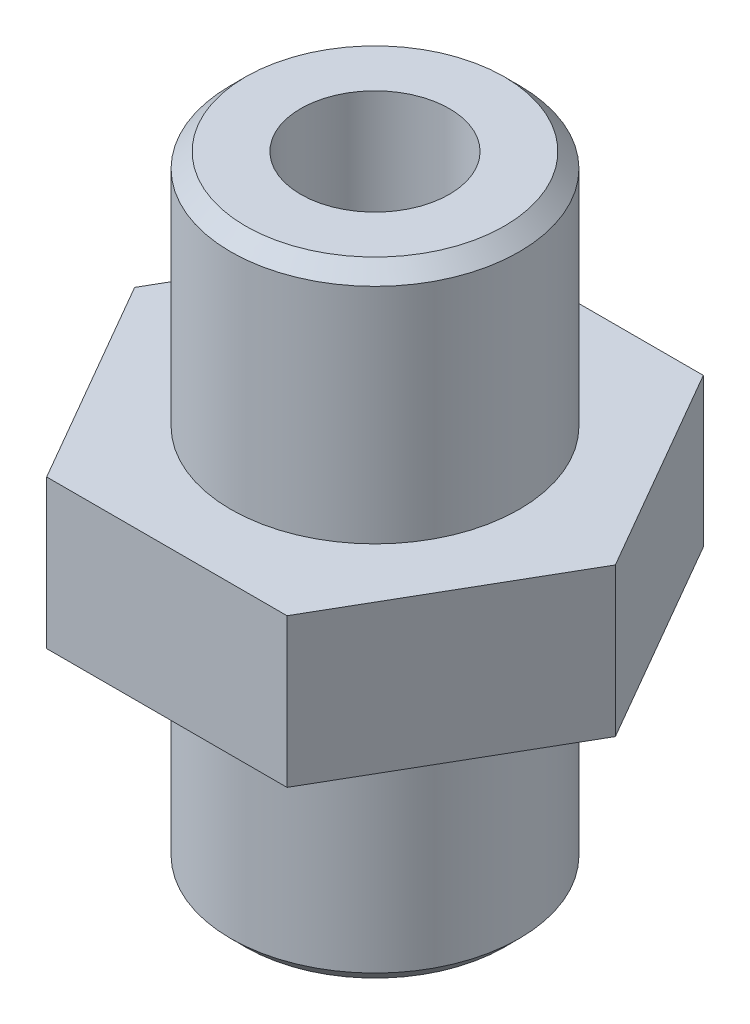
ISO-10303-21;
HEADER;
FILE_DESCRIPTION(('STEP AP214'),'2;1');
FILE_NAME('part.step','',(''),(''),'','','');
FILE_SCHEMA(('AUTOMOTIVE_DESIGN { 1 0 10303 214 1 1 1 1 }'));
ENDSEC;
DATA;
#1=APPLICATION_CONTEXT('core data for automotive mechanical design processes');
#2=APPLICATION_PROTOCOL_DEFINITION('international standard','automotive_design',2000,#1);
#3=PRODUCT_CONTEXT('',#1,'mechanical');
#4=PRODUCT('Part','Part','',(#3));
#5=PRODUCT_RELATED_PRODUCT_CATEGORY('part','',(#4));
#6=PRODUCT_DEFINITION_FORMATION('','',#4);
#7=PRODUCT_DEFINITION_CONTEXT('part definition',#1,'design');
#8=PRODUCT_DEFINITION('design','',#6,#7);
#9=PRODUCT_DEFINITION_SHAPE('','',#8);
#10=(LENGTH_UNIT() NAMED_UNIT(*) SI_UNIT(.MILLI.,.METRE.));
#11=(NAMED_UNIT(*) PLANE_ANGLE_UNIT() SI_UNIT($,.RADIAN.));
#12=(NAMED_UNIT(*) SI_UNIT($,.STERADIAN.) SOLID_ANGLE_UNIT());
#13=UNCERTAINTY_MEASURE_WITH_UNIT(LENGTH_MEASURE(1.E-05),#10,'distance_accuracy_value','');
#14=(GEOMETRIC_REPRESENTATION_CONTEXT(3) GLOBAL_UNCERTAINTY_ASSIGNED_CONTEXT((#13)) GLOBAL_UNIT_ASSIGNED_CONTEXT((#10,
#11,#12)) REPRESENTATION_CONTEXT('',''));
#15=CARTESIAN_POINT('',(0.,0.,0.));
#16=DIRECTION('',(0.,0.,1.));
#17=DIRECTION('',(1.,0.,0.));
#18=AXIS2_PLACEMENT_3D('',#15,#16,#17);
#19=CARTESIAN_POINT('',(-4.04145188432738,5.,7.));
#20=DIRECTION('',(0.,0.,-1.));
#21=DIRECTION('',(-1.,0.,0.));
#22=AXIS2_PLACEMENT_3D('',#19,#20,#21);
#23=PLANE('',#22);
#24=DIRECTION('',(1.,0.,0.));
#25=VECTOR('',#24,1.);
#26=CARTESIAN_POINT('',(-4.04145188432738,0.,7.));
#27=LINE('',#26,#25);
#28=CARTESIAN_POINT('',(-4.04145188432738,0.,7.));
#29=VERTEX_POINT('',#28);
#30=CARTESIAN_POINT('',(4.04145188432738,0.,7.));
#31=VERTEX_POINT('',#30);
#32=EDGE_CURVE('E124',#29,#31,#27,.T.);
#33=ORIENTED_EDGE('',*,*,#32,.T.);
#34=DIRECTION('',(0.,-1.,0.));
#35=VECTOR('',#34,1.);
#36=CARTESIAN_POINT('',(4.04145188432738,5.,7.));
#37=LINE('',#36,#35);
#38=CARTESIAN_POINT('',(4.04145188432738,5.,7.));
#39=VERTEX_POINT('',#38);
#40=EDGE_CURVE('E142',#39,#31,#37,.T.);
#41=ORIENTED_EDGE('',*,*,#40,.F.);
#42=DIRECTION('',(1.,0.,0.));
#43=VECTOR('',#42,1.);
#44=CARTESIAN_POINT('',(-4.04145188432738,5.,7.));
#45=LINE('',#44,#43);
#46=CARTESIAN_POINT('',(-4.04145188432738,5.,7.));
#47=VERTEX_POINT('',#46);
#48=EDGE_CURVE('E135',#47,#39,#45,.T.);
#49=ORIENTED_EDGE('',*,*,#48,.F.);
#50=DIRECTION('',(0.,-1.,0.));
#51=VECTOR('',#50,1.);
#52=CARTESIAN_POINT('',(-4.04145188432738,5.,7.));
#53=LINE('',#52,#51);
#54=EDGE_CURVE('E120',#47,#29,#53,.T.);
#55=ORIENTED_EDGE('',*,*,#54,.T.);
#56=EDGE_LOOP('',(#33,#41,#49,#55));
#57=FACE_BOUND('',#56,.T.);
#58=ADVANCED_FACE('F38',(#57),#23,.F.);
#59=CARTESIAN_POINT('',(4.04145188432738,5.,7.));
#60=DIRECTION('',(-0.866025403784438,0.,-0.5));
#61=DIRECTION('',(-0.5,0.,0.866025403784439));
#62=AXIS2_PLACEMENT_3D('',#59,#60,#61);
#63=PLANE('',#62);
#64=DIRECTION('',(0.5,0.,-0.866025403784439));
#65=VECTOR('',#64,1.);
#66=CARTESIAN_POINT('',(4.04145188432738,0.,7.));
#67=LINE('',#66,#65);
#68=CARTESIAN_POINT('',(8.08290376865476,0.,0.));
#69=VERTEX_POINT('',#68);
#70=EDGE_CURVE('E127',#31,#69,#67,.T.);
#71=ORIENTED_EDGE('',*,*,#70,.T.);
#72=DIRECTION('',(0.,-1.,0.));
#73=VECTOR('',#72,1.);
#74=CARTESIAN_POINT('',(8.08290376865476,5.,0.));
#75=LINE('',#74,#73);
#76=CARTESIAN_POINT('',(8.08290376865476,5.,0.));
#77=VERTEX_POINT('',#76);
#78=EDGE_CURVE('E139',#77,#69,#75,.T.);
#79=ORIENTED_EDGE('',*,*,#78,.F.);
#80=DIRECTION('',(0.5,0.,-0.866025403784439));
#81=VECTOR('',#80,1.);
#82=CARTESIAN_POINT('',(4.04145188432738,5.,7.));
#83=LINE('',#82,#81);
#84=EDGE_CURVE('E93',#39,#77,#83,.T.);
#85=ORIENTED_EDGE('',*,*,#84,.F.);
#86=ORIENTED_EDGE('',*,*,#40,.T.);
#87=EDGE_LOOP('',(#71,#79,#85,#86));
#88=FACE_BOUND('',#87,.T.);
#89=ADVANCED_FACE('F170',(#88),#63,.F.);
#90=CARTESIAN_POINT('',(8.08290376865476,5.,0.));
#91=DIRECTION('',(-0.866025403784438,0.,0.5));
#92=DIRECTION('',(0.5,0.,0.866025403784438));
#93=AXIS2_PLACEMENT_3D('',#90,#91,#92);
#94=PLANE('',#93);
#95=DIRECTION('',(-0.5,0.,-0.866025403784438));
#96=VECTOR('',#95,1.);
#97=CARTESIAN_POINT('',(8.08290376865476,0.,0.));
#98=LINE('',#97,#96);
#99=CARTESIAN_POINT('',(4.04145188432738,0.,-7.));
#100=VERTEX_POINT('',#99);
#101=EDGE_CURVE('E130',#69,#100,#98,.T.);
#102=ORIENTED_EDGE('',*,*,#101,.T.);
#103=DIRECTION('',(0.,-1.,0.));
#104=VECTOR('',#103,1.);
#105=CARTESIAN_POINT('',(4.04145188432738,5.,-7.));
#106=LINE('',#105,#104);
#107=CARTESIAN_POINT('',(4.04145188432738,5.,-7.));
#108=VERTEX_POINT('',#107);
#109=EDGE_CURVE('E115',#108,#100,#106,.T.);
#110=ORIENTED_EDGE('',*,*,#109,.F.);
#111=DIRECTION('',(-0.5,0.,-0.866025403784438));
#112=VECTOR('',#111,1.);
#113=CARTESIAN_POINT('',(8.08290376865476,5.,0.));
#114=LINE('',#113,#112);
#115=EDGE_CURVE('E106',#77,#108,#114,.T.);
#116=ORIENTED_EDGE('',*,*,#115,.F.);
#117=ORIENTED_EDGE('',*,*,#78,.T.);
#118=EDGE_LOOP('',(#102,#110,#116,#117));
#119=FACE_BOUND('',#118,.T.);
#120=ADVANCED_FACE('F176',(#119),#94,.F.);
#121=CARTESIAN_POINT('',(4.04145188432738,5.,-7.));
#122=DIRECTION('',(0.,0.,1.));
#123=DIRECTION('',(1.,0.,0.));
#124=AXIS2_PLACEMENT_3D('',#121,#122,#123);
#125=PLANE('',#124);
#126=DIRECTION('',(-1.,0.,0.));
#127=VECTOR('',#126,1.);
#128=CARTESIAN_POINT('',(4.04145188432738,0.,-7.));
#129=LINE('',#128,#127);
#130=CARTESIAN_POINT('',(-4.04145188432738,0.,-7.));
#131=VERTEX_POINT('',#130);
#132=EDGE_CURVE('E114',#100,#131,#129,.T.);
#133=ORIENTED_EDGE('',*,*,#132,.T.);
#134=DIRECTION('',(0.,-1.,0.));
#135=VECTOR('',#134,1.);
#136=CARTESIAN_POINT('',(-4.04145188432738,5.,-7.));
#137=LINE('',#136,#135);
#138=CARTESIAN_POINT('',(-4.04145188432738,5.,-7.));
#139=VERTEX_POINT('',#138);
#140=EDGE_CURVE('E111',#139,#131,#137,.T.);
#141=ORIENTED_EDGE('',*,*,#140,.F.);
#142=DIRECTION('',(-1.,0.,0.));
#143=VECTOR('',#142,1.);
#144=CARTESIAN_POINT('',(4.04145188432738,5.,-7.));
#145=LINE('',#144,#143);
#146=EDGE_CURVE('E100',#108,#139,#145,.T.);
#147=ORIENTED_EDGE('',*,*,#146,.F.);
#148=ORIENTED_EDGE('',*,*,#109,.T.);
#149=EDGE_LOOP('',(#133,#141,#147,#148));
#150=FACE_BOUND('',#149,.T.);
#151=ADVANCED_FACE('F112',(#150),#125,.F.);
#152=CARTESIAN_POINT('',(-4.04145188432738,5.,-7.));
#153=DIRECTION('',(0.866025403784439,0.,0.5));
#154=DIRECTION('',(0.5,0.,-0.866025403784439));
#155=AXIS2_PLACEMENT_3D('',#152,#153,#154);
#156=PLANE('',#155);
#157=DIRECTION('',(-0.5,0.,0.866025403784439));
#158=VECTOR('',#157,1.);
#159=CARTESIAN_POINT('',(-4.04145188432738,0.,-7.));
#160=LINE('',#159,#158);
#161=CARTESIAN_POINT('',(-8.08290376865476,0.,0.));
#162=VERTEX_POINT('',#161);
#163=EDGE_CURVE('E78',#131,#162,#160,.T.);
#164=ORIENTED_EDGE('',*,*,#163,.T.);
#165=DIRECTION('',(0.,-1.,0.));
#166=VECTOR('',#165,1.);
#167=CARTESIAN_POINT('',(-8.08290376865476,5.,0.));
#168=LINE('',#167,#166);
#169=CARTESIAN_POINT('',(-8.08290376865476,5.,0.));
#170=VERTEX_POINT('',#169);
#171=EDGE_CURVE('E116',#170,#162,#168,.T.);
#172=ORIENTED_EDGE('',*,*,#171,.F.);
#173=DIRECTION('',(-0.5,0.,0.866025403784439));
#174=VECTOR('',#173,1.);
#175=CARTESIAN_POINT('',(-4.04145188432738,5.,-7.));
#176=LINE('',#175,#174);
#177=EDGE_CURVE('E104',#139,#170,#176,.T.);
#178=ORIENTED_EDGE('',*,*,#177,.F.);
#179=ORIENTED_EDGE('',*,*,#140,.T.);
#180=EDGE_LOOP('',(#164,#172,#178,#179));
#181=FACE_BOUND('',#180,.T.);
#182=ADVANCED_FACE('F118',(#181),#156,.F.);
#183=CARTESIAN_POINT('',(-8.08290376865476,5.,0.));
#184=DIRECTION('',(0.866025403784439,0.,-0.5));
#185=DIRECTION('',(-0.5,0.,-0.866025403784439));
#186=AXIS2_PLACEMENT_3D('',#183,#184,#185);
#187=PLANE('',#186);
#188=DIRECTION('',(0.5,0.,0.866025403784439));
#189=VECTOR('',#188,1.);
#190=CARTESIAN_POINT('',(-8.08290376865476,0.,0.));
#191=LINE('',#190,#189);
#192=EDGE_CURVE('E84',#162,#29,#191,.T.);
#193=ORIENTED_EDGE('',*,*,#192,.T.);
#194=ORIENTED_EDGE('',*,*,#54,.F.);
#195=DIRECTION('',(0.5,0.,0.866025403784439));
#196=VECTOR('',#195,1.);
#197=CARTESIAN_POINT('',(-8.08290376865476,5.,0.));
#198=LINE('',#197,#196);
#199=EDGE_CURVE('E55',#170,#47,#198,.T.);
#200=ORIENTED_EDGE('',*,*,#199,.F.);
#201=ORIENTED_EDGE('',*,*,#171,.T.);
#202=EDGE_LOOP('',(#193,#194,#200,#201));
#203=FACE_BOUND('',#202,.T.);
#204=ADVANCED_FACE('F186',(#203),#187,.F.);
#205=CARTESIAN_POINT('',(0.,5.,0.));
#206=DIRECTION('',(0.,1.,0.));
#207=DIRECTION('',(0.,0.,1.));
#208=AXIS2_PLACEMENT_3D('',#205,#206,#207);
#209=PLANE('',#208);
#210=CARTESIAN_POINT('',(0.,5.,0.));
#211=DIRECTION('',(0.,1.,0.));
#212=DIRECTION('',(0.,0.,1.));
#213=AXIS2_PLACEMENT_3D('',#210,#211,#212);
#214=CIRCLE('',#213,4.85);
#215=CARTESIAN_POINT('',(0.,5.,4.85));
#216=VERTEX_POINT('',#215);
#217=EDGE_CURVE('E144',#216,#216,#214,.T.);
#218=ORIENTED_EDGE('',*,*,#217,.F.);
#219=EDGE_LOOP('',(#218));
#220=FACE_BOUND('',#219,.T.);
#221=ORIENTED_EDGE('',*,*,#48,.T.);
#222=ORIENTED_EDGE('',*,*,#84,.T.);
#223=ORIENTED_EDGE('',*,*,#115,.T.);
#224=ORIENTED_EDGE('',*,*,#146,.T.);
#225=ORIENTED_EDGE('',*,*,#177,.T.);
#226=ORIENTED_EDGE('',*,*,#199,.T.);
#227=EDGE_LOOP('',(#221,#222,#223,#224,#225,#226));
#228=FACE_BOUND('',#227,.T.);
#229=ADVANCED_FACE('F102',(#220,#228),#209,.T.);
#230=CARTESIAN_POINT('',(0.,0.,0.));
#231=DIRECTION('',(0.,1.,0.));
#232=DIRECTION('',(0.,0.,1.));
#233=AXIS2_PLACEMENT_3D('',#230,#231,#232);
#234=PLANE('',#233);
#235=CARTESIAN_POINT('',(0.,0.,0.));
#236=DIRECTION('',(0.,-1.,0.));
#237=DIRECTION('',(0.,0.,-1.));
#238=AXIS2_PLACEMENT_3D('',#235,#236,#237);
#239=CIRCLE('',#238,4.85);
#240=CARTESIAN_POINT('',(0.,0.,-4.85));
#241=VERTEX_POINT('',#240);
#242=EDGE_CURVE('E149',#241,#241,#239,.T.);
#243=ORIENTED_EDGE('',*,*,#242,.F.);
#244=EDGE_LOOP('',(#243));
#245=FACE_BOUND('',#244,.T.);
#246=ORIENTED_EDGE('',*,*,#32,.F.);
#247=ORIENTED_EDGE('',*,*,#192,.F.);
#248=ORIENTED_EDGE('',*,*,#163,.F.);
#249=ORIENTED_EDGE('',*,*,#132,.F.);
#250=ORIENTED_EDGE('',*,*,#101,.F.);
#251=ORIENTED_EDGE('',*,*,#70,.F.);
#252=EDGE_LOOP('',(#246,#247,#248,#249,#250,#251));
#253=FACE_BOUND('',#252,.T.);
#254=ADVANCED_FACE('F189',(#245,#253),#234,.F.);
#255=CARTESIAN_POINT('',(0.,13.,0.));
#256=DIRECTION('',(0.,-1.,0.));
#257=DIRECTION('',(0.,0.,-1.));
#258=AXIS2_PLACEMENT_3D('',#255,#256,#257);
#259=CYLINDRICAL_SURFACE('',#258,4.85);
#260=CARTESIAN_POINT('',(0.,12.5,0.));
#261=DIRECTION('',(0.,1.,0.));
#262=DIRECTION('',(0.,0.,1.));
#263=AXIS2_PLACEMENT_3D('',#260,#261,#262);
#264=CIRCLE('',#263,4.85);
#265=CARTESIAN_POINT('',(0.,12.5,4.85));
#266=VERTEX_POINT('',#265);
#267=EDGE_CURVE('E11',#266,#266,#264,.F.);
#268=ORIENTED_EDGE('',*,*,#267,.T.);
#269=EDGE_LOOP('',(#268));
#270=FACE_BOUND('',#269,.T.);
#271=ORIENTED_EDGE('',*,*,#217,.T.);
#272=EDGE_LOOP('',(#271));
#273=FACE_BOUND('',#272,.T.);
#274=ADVANCED_FACE('F192',(#270,#273),#259,.T.);
#275=CARTESIAN_POINT('',(0.,13.,0.));
#276=DIRECTION('',(0.,1.,0.));
#277=DIRECTION('',(0.,0.,1.));
#278=AXIS2_PLACEMENT_3D('',#275,#276,#277);
#279=PLANE('',#278);
#280=CARTESIAN_POINT('',(0.,13.,0.));
#281=DIRECTION('',(0.,1.,0.));
#282=DIRECTION('',(0.,0.,1.));
#283=AXIS2_PLACEMENT_3D('',#280,#281,#282);
#284=CIRCLE('',#283,2.5);
#285=CARTESIAN_POINT('',(0.,13.,2.5));
#286=VERTEX_POINT('',#285);
#287=EDGE_CURVE('E216',#286,#286,#284,.T.);
#288=ORIENTED_EDGE('',*,*,#287,.F.);
#289=EDGE_LOOP('',(#288));
#290=FACE_BOUND('',#289,.T.);
#291=CARTESIAN_POINT('',(0.,13.,0.));
#292=DIRECTION('',(0.,1.,0.));
#293=DIRECTION('',(0.,0.,1.));
#294=AXIS2_PLACEMENT_3D('',#291,#292,#293);
#295=CIRCLE('',#294,4.35);
#296=CARTESIAN_POINT('',(0.,13.,4.35));
#297=VERTEX_POINT('',#296);
#298=EDGE_CURVE('E47',#297,#297,#295,.T.);
#299=ORIENTED_EDGE('',*,*,#298,.T.);
#300=EDGE_LOOP('',(#299));
#301=FACE_BOUND('',#300,.T.);
#302=ADVANCED_FACE('F154',(#290,#301),#279,.T.);
#303=CARTESIAN_POINT('',(0.,-8.,0.));
#304=DIRECTION('',(0.,1.,0.));
#305=DIRECTION('',(0.,0.,1.));
#306=AXIS2_PLACEMENT_3D('',#303,#304,#305);
#307=CYLINDRICAL_SURFACE('',#306,4.85);
#308=CARTESIAN_POINT('',(0.,-7.5,0.));
#309=DIRECTION('',(0.,-1.,0.));
#310=DIRECTION('',(0.,0.,-1.));
#311=AXIS2_PLACEMENT_3D('',#308,#309,#310);
#312=CIRCLE('',#311,4.85);
#313=CARTESIAN_POINT('',(0.,-7.5,-4.85));
#314=VERTEX_POINT('',#313);
#315=EDGE_CURVE('E148',#314,#314,#312,.F.);
#316=ORIENTED_EDGE('',*,*,#315,.T.);
#317=EDGE_LOOP('',(#316));
#318=FACE_BOUND('',#317,.T.);
#319=ORIENTED_EDGE('',*,*,#242,.T.);
#320=EDGE_LOOP('',(#319));
#321=FACE_BOUND('',#320,.T.);
#322=ADVANCED_FACE('F202',(#318,#321),#307,.T.);
#323=CARTESIAN_POINT('',(0.,-8.,0.));
#324=DIRECTION('',(0.,-1.,0.));
#325=DIRECTION('',(0.,0.,-1.));
#326=AXIS2_PLACEMENT_3D('',#323,#324,#325);
#327=PLANE('',#326);
#328=CARTESIAN_POINT('',(0.,-8.,0.));
#329=DIRECTION('',(0.,1.,0.));
#330=DIRECTION('',(0.,0.,1.));
#331=AXIS2_PLACEMENT_3D('',#328,#329,#330);
#332=CIRCLE('',#331,2.5);
#333=CARTESIAN_POINT('',(0.,-8.,2.5));
#334=VERTEX_POINT('',#333);
#335=EDGE_CURVE('E128',#334,#334,#332,.T.);
#336=ORIENTED_EDGE('',*,*,#335,.T.);
#337=EDGE_LOOP('',(#336));
#338=FACE_BOUND('',#337,.T.);
#339=CARTESIAN_POINT('',(0.,-8.,0.));
#340=DIRECTION('',(0.,-1.,0.));
#341=DIRECTION('',(0.,0.,-1.));
#342=AXIS2_PLACEMENT_3D('',#339,#340,#341);
#343=CIRCLE('',#342,4.35);
#344=CARTESIAN_POINT('',(0.,-8.,-4.35));
#345=VERTEX_POINT('',#344);
#346=EDGE_CURVE('E145',#345,#345,#343,.T.);
#347=ORIENTED_EDGE('',*,*,#346,.T.);
#348=EDGE_LOOP('',(#347));
#349=FACE_BOUND('',#348,.T.);
#350=ADVANCED_FACE('F166',(#338,#349),#327,.T.);
#351=CARTESIAN_POINT('',(0.,-8.,0.));
#352=DIRECTION('',(0.,1.,0.));
#353=DIRECTION('',(0.,0.,1.));
#354=AXIS2_PLACEMENT_3D('',#351,#352,#353);
#355=CONICAL_SURFACE('',#354,4.35,0.785398163397446);
#356=ORIENTED_EDGE('',*,*,#315,.F.);
#357=EDGE_LOOP('',(#356));
#358=FACE_BOUND('',#357,.T.);
#359=ORIENTED_EDGE('',*,*,#346,.F.);
#360=EDGE_LOOP('',(#359));
#361=FACE_BOUND('',#360,.T.);
#362=ADVANCED_FACE('F158',(#358,#361),#355,.T.);
#363=CARTESIAN_POINT('',(0.,13.,0.));
#364=DIRECTION('',(0.,-1.,0.));
#365=DIRECTION('',(0.,0.,-1.));
#366=AXIS2_PLACEMENT_3D('',#363,#364,#365);
#367=CONICAL_SURFACE('',#366,4.35,0.785398163397446);
#368=ORIENTED_EDGE('',*,*,#267,.F.);
#369=EDGE_LOOP('',(#368));
#370=FACE_BOUND('',#369,.T.);
#371=ORIENTED_EDGE('',*,*,#298,.F.);
#372=EDGE_LOOP('',(#371));
#373=FACE_BOUND('',#372,.T.);
#374=ADVANCED_FACE('F40',(#370,#373),#367,.T.);
#375=CARTESIAN_POINT('',(0.,-8.,0.));
#376=DIRECTION('',(0.,1.,0.));
#377=DIRECTION('',(0.,0.,1.));
#378=AXIS2_PLACEMENT_3D('',#375,#376,#377);
#379=CYLINDRICAL_SURFACE('',#378,2.5);
#380=ORIENTED_EDGE('',*,*,#335,.F.);
#381=EDGE_LOOP('',(#380));
#382=FACE_BOUND('',#381,.T.);
#383=ORIENTED_EDGE('',*,*,#287,.T.);
#384=EDGE_LOOP('',(#383));
#385=FACE_BOUND('',#384,.T.);
#386=ADVANCED_FACE('F157',(#382,#385),#379,.F.);
#387=CLOSED_SHELL('',(#58,#89,#120,#151,#182,#204,#229,#254,#274,#302,#322,#350,#362,#374,#386));
#388=MANIFOLD_SOLID_BREP('B2',#387);
#389=ADVANCED_BREP_SHAPE_REPRESENTATION('',(#18,#388),#14);
#390=SHAPE_DEFINITION_REPRESENTATION(#9,#389);
ENDSEC;
END-ISO-10303-21;
